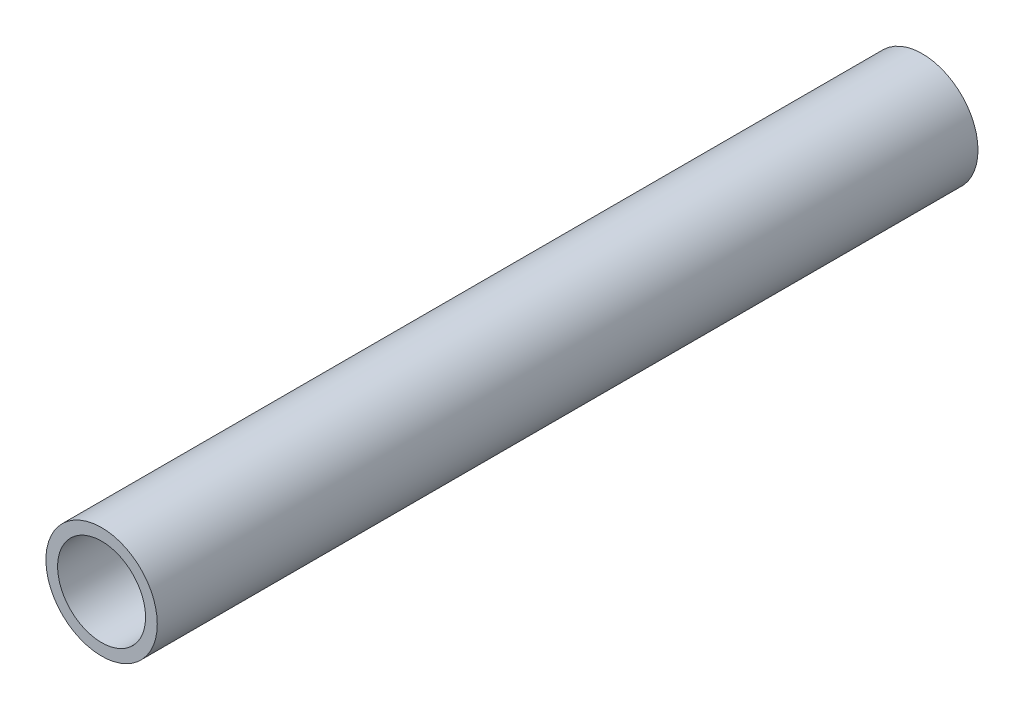
ISO-10303-21;
HEADER;
FILE_DESCRIPTION(('STEP AP214'),'2;1');
FILE_NAME('part.step','',(''),(''),'','','');
FILE_SCHEMA(('AUTOMOTIVE_DESIGN { 1 0 10303 214 1 1 1 1 }'));
ENDSEC;
DATA;
#1=APPLICATION_CONTEXT('core data for automotive mechanical design processes');
#2=APPLICATION_PROTOCOL_DEFINITION('international standard','automotive_design',2000,#1);
#3=PRODUCT_CONTEXT('',#1,'mechanical');
#4=PRODUCT('Part','Part','',(#3));
#5=PRODUCT_RELATED_PRODUCT_CATEGORY('part','',(#4));
#6=PRODUCT_DEFINITION_FORMATION('','',#4);
#7=PRODUCT_DEFINITION_CONTEXT('part definition',#1,'design');
#8=PRODUCT_DEFINITION('design','',#6,#7);
#9=PRODUCT_DEFINITION_SHAPE('','',#8);
#10=(LENGTH_UNIT() NAMED_UNIT(*) SI_UNIT(.MILLI.,.METRE.));
#11=(NAMED_UNIT(*) PLANE_ANGLE_UNIT() SI_UNIT($,.RADIAN.));
#12=(NAMED_UNIT(*) SI_UNIT($,.STERADIAN.) SOLID_ANGLE_UNIT());
#13=UNCERTAINTY_MEASURE_WITH_UNIT(LENGTH_MEASURE(1.E-05),#10,'distance_accuracy_value','');
#14=(GEOMETRIC_REPRESENTATION_CONTEXT(3) GLOBAL_UNCERTAINTY_ASSIGNED_CONTEXT((#13)) GLOBAL_UNIT_ASSIGNED_CONTEXT((#10,
#11,#12)) REPRESENTATION_CONTEXT('',''));
#15=CARTESIAN_POINT('',(0.,0.,0.));
#16=DIRECTION('',(0.,0.,1.));
#17=DIRECTION('',(1.,0.,0.));
#18=AXIS2_PLACEMENT_3D('',#15,#16,#17);
#19=CARTESIAN_POINT('',(0.,0.,70.));
#20=DIRECTION('',(0.,0.,1.));
#21=DIRECTION('',(1.,0.,0.));
#22=AXIS2_PLACEMENT_3D('',#19,#20,#21);
#23=PLANE('',#22);
#24=CARTESIAN_POINT('',(0.,0.,70.));
#25=DIRECTION('',(0.,0.,1.));
#26=DIRECTION('',(1.,0.,0.));
#27=AXIS2_PLACEMENT_3D('',#24,#25,#26);
#28=CIRCLE('',#27,4.75);
#29=CARTESIAN_POINT('',(4.75,0.,70.));
#30=VERTEX_POINT('',#29);
#31=EDGE_CURVE('E10',#30,#30,#28,.T.);
#32=ORIENTED_EDGE('',*,*,#31,.T.);
#33=EDGE_LOOP('',(#32));
#34=FACE_BOUND('',#33,.T.);
#35=CARTESIAN_POINT('',(0.,0.,70.));
#36=DIRECTION('',(0.,0.,1.));
#37=DIRECTION('',(1.,0.,0.));
#38=AXIS2_PLACEMENT_3D('',#35,#36,#37);
#39=CIRCLE('',#38,3.75);
#40=CARTESIAN_POINT('',(3.75,0.,70.));
#41=VERTEX_POINT('',#40);
#42=EDGE_CURVE('E52',#41,#41,#39,.T.);
#43=ORIENTED_EDGE('',*,*,#42,.F.);
#44=EDGE_LOOP('',(#43));
#45=FACE_BOUND('',#44,.T.);
#46=ADVANCED_FACE('F39',(#34,#45),#23,.T.);
#47=CARTESIAN_POINT('',(0.,0.,0.));
#48=DIRECTION('',(0.,0.,1.));
#49=DIRECTION('',(1.,0.,0.));
#50=AXIS2_PLACEMENT_3D('',#47,#48,#49);
#51=PLANE('',#50);
#52=CARTESIAN_POINT('',(0.,0.,0.));
#53=DIRECTION('',(0.,0.,1.));
#54=DIRECTION('',(1.,0.,0.));
#55=AXIS2_PLACEMENT_3D('',#52,#53,#54);
#56=CIRCLE('',#55,4.75);
#57=CARTESIAN_POINT('',(4.75,0.,0.));
#58=VERTEX_POINT('',#57);
#59=EDGE_CURVE('E43',#58,#58,#56,.T.);
#60=ORIENTED_EDGE('',*,*,#59,.F.);
#61=EDGE_LOOP('',(#60));
#62=FACE_BOUND('',#61,.T.);
#63=CARTESIAN_POINT('',(0.,0.,0.));
#64=DIRECTION('',(0.,0.,1.));
#65=DIRECTION('',(1.,0.,0.));
#66=AXIS2_PLACEMENT_3D('',#63,#64,#65);
#67=CIRCLE('',#66,3.75);
#68=CARTESIAN_POINT('',(3.75,0.,0.));
#69=VERTEX_POINT('',#68);
#70=EDGE_CURVE('E54',#69,#69,#67,.T.);
#71=ORIENTED_EDGE('',*,*,#70,.T.);
#72=EDGE_LOOP('',(#71));
#73=FACE_BOUND('',#72,.T.);
#74=ADVANCED_FACE('F66',(#62,#73),#51,.F.);
#75=CARTESIAN_POINT('',(0.,0.,70.));
#76=DIRECTION('',(0.,0.,-1.));
#77=DIRECTION('',(-1.,0.,0.));
#78=AXIS2_PLACEMENT_3D('',#75,#76,#77);
#79=CYLINDRICAL_SURFACE('',#78,4.75);
#80=ORIENTED_EDGE('',*,*,#31,.F.);
#81=EDGE_LOOP('',(#80));
#82=FACE_BOUND('',#81,.T.);
#83=ORIENTED_EDGE('',*,*,#59,.T.);
#84=EDGE_LOOP('',(#83));
#85=FACE_BOUND('',#84,.T.);
#86=ADVANCED_FACE('F41',(#82,#85),#79,.T.);
#87=CARTESIAN_POINT('',(0.,0.,70.));
#88=DIRECTION('',(0.,0.,-1.));
#89=DIRECTION('',(-1.,0.,0.));
#90=AXIS2_PLACEMENT_3D('',#87,#88,#89);
#91=CYLINDRICAL_SURFACE('',#90,3.75);
#92=ORIENTED_EDGE('',*,*,#42,.T.);
#93=EDGE_LOOP('',(#92));
#94=FACE_BOUND('',#93,.T.);
#95=ORIENTED_EDGE('',*,*,#70,.F.);
#96=EDGE_LOOP('',(#95));
#97=FACE_BOUND('',#96,.T.);
#98=ADVANCED_FACE('F62',(#94,#97),#91,.F.);
#99=CLOSED_SHELL('',(#46,#74,#86,#98));
#100=MANIFOLD_SOLID_BREP('B2',#99);
#101=ADVANCED_BREP_SHAPE_REPRESENTATION('',(#18,#100),#14);
#102=SHAPE_DEFINITION_REPRESENTATION(#9,#101);
ENDSEC;
END-ISO-10303-21;
